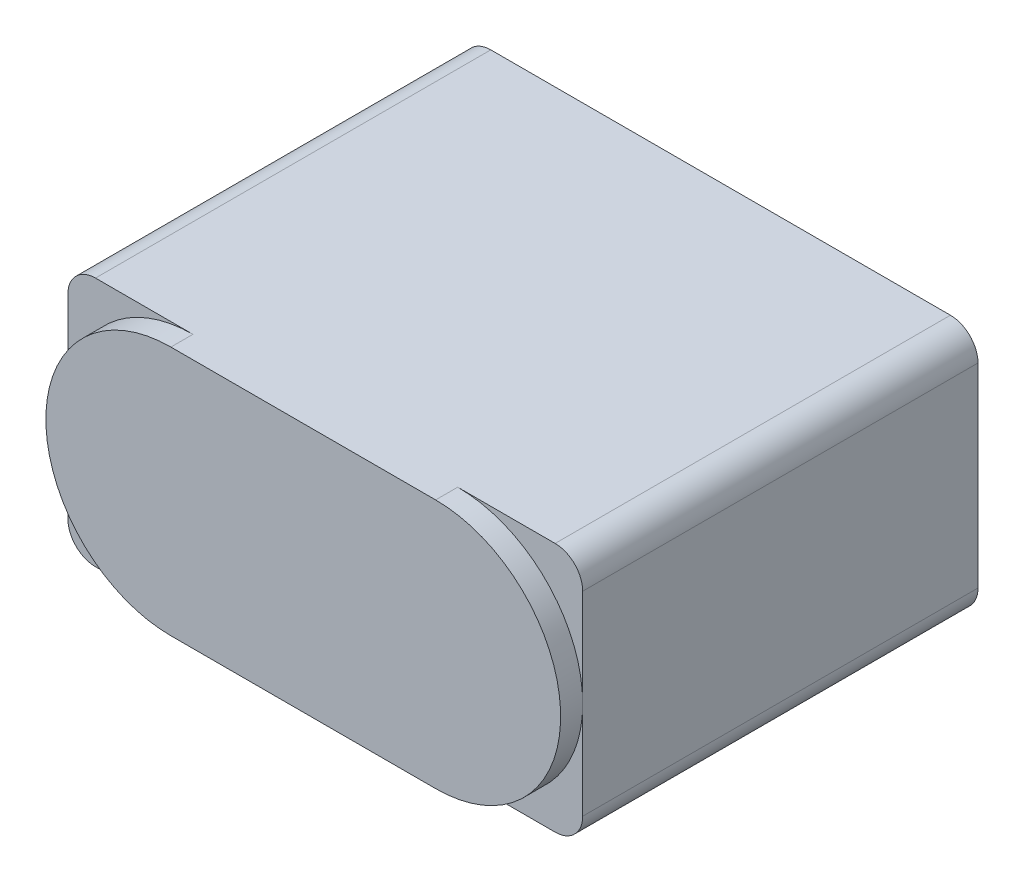
ISO-10303-21;
HEADER;
FILE_DESCRIPTION(('STEP AP214'),'2;1');
FILE_NAME('part.step','',(''),(''),'','','');
FILE_SCHEMA(('AUTOMOTIVE_DESIGN { 1 0 10303 214 1 1 1 1 }'));
ENDSEC;
DATA;
#1=APPLICATION_CONTEXT('core data for automotive mechanical design processes');
#2=APPLICATION_PROTOCOL_DEFINITION('international standard','automotive_design',2000,#1);
#3=PRODUCT_CONTEXT('',#1,'mechanical');
#4=PRODUCT('Part','Part','',(#3));
#5=PRODUCT_RELATED_PRODUCT_CATEGORY('part','',(#4));
#6=PRODUCT_DEFINITION_FORMATION('','',#4);
#7=PRODUCT_DEFINITION_CONTEXT('part definition',#1,'design');
#8=PRODUCT_DEFINITION('design','',#6,#7);
#9=PRODUCT_DEFINITION_SHAPE('','',#8);
#10=(LENGTH_UNIT() NAMED_UNIT(*) SI_UNIT(.MILLI.,.METRE.));
#11=(NAMED_UNIT(*) PLANE_ANGLE_UNIT() SI_UNIT($,.RADIAN.));
#12=(NAMED_UNIT(*) SI_UNIT($,.STERADIAN.) SOLID_ANGLE_UNIT());
#13=UNCERTAINTY_MEASURE_WITH_UNIT(LENGTH_MEASURE(1.E-05),#10,'distance_accuracy_value','');
#14=(GEOMETRIC_REPRESENTATION_CONTEXT(3) GLOBAL_UNCERTAINTY_ASSIGNED_CONTEXT((#13)) GLOBAL_UNIT_ASSIGNED_CONTEXT((#10,
#11,#12)) REPRESENTATION_CONTEXT('',''));
#15=CARTESIAN_POINT('',(0.,0.,0.));
#16=DIRECTION('',(0.,0.,1.));
#17=DIRECTION('',(1.,0.,0.));
#18=AXIS2_PLACEMENT_3D('',#15,#16,#17);
#19=CARTESIAN_POINT('',(0.,1.50000000000001,22.7));
#20=DIRECTION('',(1.,0.,0.));
#21=DIRECTION('',(0.,0.,-1.));
#22=AXIS2_PLACEMENT_3D('',#19,#20,#21);
#23=PLANE('',#22);
#24=DIRECTION('',(0.,-1.,0.));
#25=VECTOR('',#24,1.);
#26=CARTESIAN_POINT('',(0.,0.,21.5));
#27=LINE('',#26,#25);
#28=CARTESIAN_POINT('',(0.,6.8,21.5));
#29=VERTEX_POINT('',#28);
#30=CARTESIAN_POINT('',(0.,1.5,21.5));
#31=VERTEX_POINT('',#30);
#32=EDGE_CURVE('E224',#29,#31,#27,.T.);
#33=ORIENTED_EDGE('',*,*,#32,.F.);
#34=DIRECTION('',(0.,-1.,0.));
#35=VECTOR('',#34,1.);
#36=CARTESIAN_POINT('',(0.,0.,21.5));
#37=LINE('',#36,#35);
#38=CARTESIAN_POINT('',(0.,12.1,21.5));
#39=VERTEX_POINT('',#38);
#40=EDGE_CURVE('E256',#39,#29,#37,.T.);
#41=ORIENTED_EDGE('',*,*,#40,.F.);
#42=DIRECTION('',(0.,0.,-1.));
#43=VECTOR('',#42,1.);
#44=CARTESIAN_POINT('',(0.,12.1,22.7));
#45=LINE('',#44,#43);
#46=CARTESIAN_POINT('',(0.,12.1,0.));
#47=VERTEX_POINT('',#46);
#48=EDGE_CURVE('E310',#39,#47,#45,.T.);
#49=ORIENTED_EDGE('',*,*,#48,.T.);
#50=DIRECTION('',(0.,-1.,0.));
#51=VECTOR('',#50,1.);
#52=CARTESIAN_POINT('',(0.,1.50000000000001,0.));
#53=LINE('',#52,#51);
#54=CARTESIAN_POINT('',(0.,1.5,0.));
#55=VERTEX_POINT('',#54);
#56=EDGE_CURVE('E297',#47,#55,#53,.T.);
#57=ORIENTED_EDGE('',*,*,#56,.T.);
#58=DIRECTION('',(0.,0.,-1.));
#59=VECTOR('',#58,1.);
#60=CARTESIAN_POINT('',(0.,1.5,22.7));
#61=LINE('',#60,#59);
#62=EDGE_CURVE('E308',#31,#55,#61,.T.);
#63=ORIENTED_EDGE('',*,*,#62,.F.);
#64=EDGE_LOOP('',(#33,#41,#49,#57,#63));
#65=FACE_BOUND('',#64,.T.);
#66=ADVANCED_FACE('F62',(#65),#23,.F.);
#67=CARTESIAN_POINT('',(26.5,1.5,22.7));
#68=DIRECTION('',(0.,0.,1.));
#69=DIRECTION('',(1.,0.,0.));
#70=AXIS2_PLACEMENT_3D('',#67,#68,#69);
#71=PLANE('',#70);
#72=CARTESIAN_POINT('',(6.8,6.8,22.7));
#73=DIRECTION('',(0.,0.,1.));
#74=DIRECTION('',(1.,0.,0.));
#75=AXIS2_PLACEMENT_3D('',#72,#73,#74);
#76=CIRCLE('',#75,6.8);
#77=CARTESIAN_POINT('',(6.8,13.6,22.7));
#78=VERTEX_POINT('',#77);
#79=CARTESIAN_POINT('',(6.8,0.,22.7));
#80=VERTEX_POINT('',#79);
#81=EDGE_CURVE('E252',#78,#80,#76,.T.);
#82=ORIENTED_EDGE('',*,*,#81,.T.);
#83=DIRECTION('',(1.,0.,0.));
#84=VECTOR('',#83,1.);
#85=CARTESIAN_POINT('',(1.50000000000001,0.,22.7));
#86=LINE('',#85,#84);
#87=CARTESIAN_POINT('',(21.2,0.,22.7));
#88=VERTEX_POINT('',#87);
#89=EDGE_CURVE('E278',#80,#88,#86,.T.);
#90=ORIENTED_EDGE('',*,*,#89,.T.);
#91=CARTESIAN_POINT('',(21.2,6.8,22.7));
#92=DIRECTION('',(0.,0.,1.));
#93=DIRECTION('',(1.,0.,0.));
#94=AXIS2_PLACEMENT_3D('',#91,#92,#93);
#95=CIRCLE('',#94,6.8);
#96=CARTESIAN_POINT('',(21.2,13.6,22.7));
#97=VERTEX_POINT('',#96);
#98=EDGE_CURVE('E235',#88,#97,#95,.T.);
#99=ORIENTED_EDGE('',*,*,#98,.T.);
#100=DIRECTION('',(-1.,0.,0.));
#101=VECTOR('',#100,1.);
#102=CARTESIAN_POINT('',(1.50000000000001,13.6,22.7));
#103=LINE('',#102,#101);
#104=EDGE_CURVE('E275',#97,#78,#103,.T.);
#105=ORIENTED_EDGE('',*,*,#104,.T.);
#106=EDGE_LOOP('',(#82,#90,#99,#105));
#107=FACE_BOUND('',#106,.T.);
#108=ADVANCED_FACE('F371',(#107),#71,.T.);
#109=CARTESIAN_POINT('',(26.5,1.5,22.7));
#110=DIRECTION('',(0.,0.,-1.));
#111=DIRECTION('',(-1.,0.,0.));
#112=AXIS2_PLACEMENT_3D('',#109,#110,#111);
#113=CYLINDRICAL_SURFACE('',#112,1.5);
#114=CARTESIAN_POINT('',(26.5,1.5,21.5));
#115=DIRECTION('',(0.,0.,1.));
#116=DIRECTION('',(1.,0.,0.));
#117=AXIS2_PLACEMENT_3D('',#114,#115,#116);
#118=CIRCLE('',#117,1.5);
#119=CARTESIAN_POINT('',(26.5,0.,21.5));
#120=VERTEX_POINT('',#119);
#121=CARTESIAN_POINT('',(28.,1.50000000000001,21.5));
#122=VERTEX_POINT('',#121);
#123=EDGE_CURVE('E242',#120,#122,#118,.T.);
#124=ORIENTED_EDGE('',*,*,#123,.F.);
#125=DIRECTION('',(0.,0.,-1.));
#126=VECTOR('',#125,1.);
#127=CARTESIAN_POINT('',(26.5,0.,22.7));
#128=LINE('',#127,#126);
#129=CARTESIAN_POINT('',(26.5,0.,0.));
#130=VERTEX_POINT('',#129);
#131=EDGE_CURVE('E282',#120,#130,#128,.T.);
#132=ORIENTED_EDGE('',*,*,#131,.T.);
#133=CARTESIAN_POINT('',(26.5,1.5,0.));
#134=DIRECTION('',(0.,0.,1.));
#135=DIRECTION('',(1.,0.,0.));
#136=AXIS2_PLACEMENT_3D('',#133,#134,#135);
#137=CIRCLE('',#136,1.5);
#138=CARTESIAN_POINT('',(28.,1.50000000000001,0.));
#139=VERTEX_POINT('',#138);
#140=EDGE_CURVE('E263',#130,#139,#137,.T.);
#141=ORIENTED_EDGE('',*,*,#140,.T.);
#142=DIRECTION('',(0.,0.,-1.));
#143=VECTOR('',#142,1.);
#144=CARTESIAN_POINT('',(28.,1.50000000000001,22.7));
#145=LINE('',#144,#143);
#146=EDGE_CURVE('E12',#122,#139,#145,.T.);
#147=ORIENTED_EDGE('',*,*,#146,.F.);
#148=EDGE_LOOP('',(#124,#132,#141,#147));
#149=FACE_BOUND('',#148,.T.);
#150=ADVANCED_FACE('F64',(#149),#113,.T.);
#151=CARTESIAN_POINT('',(28.,1.50000000000001,22.7));
#152=DIRECTION('',(-1.,0.,0.));
#153=DIRECTION('',(0.,0.,1.));
#154=AXIS2_PLACEMENT_3D('',#151,#152,#153);
#155=PLANE('',#154);
#156=DIRECTION('',(0.,1.,0.));
#157=VECTOR('',#156,1.);
#158=CARTESIAN_POINT('',(28.,0.,21.5));
#159=LINE('',#158,#157);
#160=CARTESIAN_POINT('',(28.,6.8,21.5));
#161=VERTEX_POINT('',#160);
#162=EDGE_CURVE('E244',#122,#161,#159,.T.);
#163=ORIENTED_EDGE('',*,*,#162,.F.);
#164=ORIENTED_EDGE('',*,*,#146,.T.);
#165=DIRECTION('',(0.,1.,0.));
#166=VECTOR('',#165,1.);
#167=CARTESIAN_POINT('',(28.,1.50000000000001,0.));
#168=LINE('',#167,#166);
#169=CARTESIAN_POINT('',(28.,12.1,0.));
#170=VERTEX_POINT('',#169);
#171=EDGE_CURVE('E285',#139,#170,#168,.T.);
#172=ORIENTED_EDGE('',*,*,#171,.T.);
#173=DIRECTION('',(0.,0.,-1.));
#174=VECTOR('',#173,1.);
#175=CARTESIAN_POINT('',(28.,12.1,22.7));
#176=LINE('',#175,#174);
#177=CARTESIAN_POINT('',(28.,12.1,21.5));
#178=VERTEX_POINT('',#177);
#179=EDGE_CURVE('E70',#178,#170,#176,.T.);
#180=ORIENTED_EDGE('',*,*,#179,.F.);
#181=DIRECTION('',(0.,1.,0.));
#182=VECTOR('',#181,1.);
#183=CARTESIAN_POINT('',(28.,0.,21.5));
#184=LINE('',#183,#182);
#185=EDGE_CURVE('E266',#161,#178,#184,.T.);
#186=ORIENTED_EDGE('',*,*,#185,.F.);
#187=EDGE_LOOP('',(#163,#164,#172,#180,#186));
#188=FACE_BOUND('',#187,.T.);
#189=ADVANCED_FACE('F326',(#188),#155,.F.);
#190=CARTESIAN_POINT('',(1.5,1.5,22.7));
#191=DIRECTION('',(0.,0.,-1.));
#192=DIRECTION('',(-1.,0.,0.));
#193=AXIS2_PLACEMENT_3D('',#190,#191,#192);
#194=CYLINDRICAL_SURFACE('',#193,1.5);
#195=CARTESIAN_POINT('',(1.5,1.5,21.5));
#196=DIRECTION('',(0.,0.,1.));
#197=DIRECTION('',(1.,0.,0.));
#198=AXIS2_PLACEMENT_3D('',#195,#196,#197);
#199=CIRCLE('',#198,1.5);
#200=CARTESIAN_POINT('',(1.50000000000001,0.,21.5));
#201=VERTEX_POINT('',#200);
#202=EDGE_CURVE('E227',#31,#201,#199,.T.);
#203=ORIENTED_EDGE('',*,*,#202,.F.);
#204=ORIENTED_EDGE('',*,*,#62,.T.);
#205=CARTESIAN_POINT('',(1.5,1.5,0.));
#206=DIRECTION('',(0.,0.,1.));
#207=DIRECTION('',(-1.,0.,0.));
#208=AXIS2_PLACEMENT_3D('',#205,#206,#207);
#209=CIRCLE('',#208,1.5);
#210=CARTESIAN_POINT('',(1.50000000000001,0.,0.));
#211=VERTEX_POINT('',#210);
#212=EDGE_CURVE('E300',#55,#211,#209,.T.);
#213=ORIENTED_EDGE('',*,*,#212,.T.);
#214=DIRECTION('',(0.,0.,-1.));
#215=VECTOR('',#214,1.);
#216=CARTESIAN_POINT('',(1.50000000000001,0.,22.7));
#217=LINE('',#216,#215);
#218=EDGE_CURVE('E306',#201,#211,#217,.T.);
#219=ORIENTED_EDGE('',*,*,#218,.F.);
#220=EDGE_LOOP('',(#203,#204,#213,#219));
#221=FACE_BOUND('',#220,.T.);
#222=ADVANCED_FACE('F357',(#221),#194,.T.);
#223=CARTESIAN_POINT('',(1.50000000000001,0.,22.7));
#224=DIRECTION('',(0.,1.,0.));
#225=DIRECTION('',(0.,0.,1.));
#226=AXIS2_PLACEMENT_3D('',#223,#224,#225);
#227=PLANE('',#226);
#228=CARTESIAN_POINT('',(24.8,0.,11.6));
#229=DIRECTION('',(0.,-1.,0.));
#230=DIRECTION('',(0.,0.,-1.));
#231=AXIS2_PLACEMENT_3D('',#228,#229,#230);
#232=CIRCLE('',#231,0.750000000000002);
#233=CARTESIAN_POINT('',(24.8,0.,10.85));
#234=VERTEX_POINT('',#233);
#235=EDGE_CURVE('E670',#234,#234,#232,.T.);
#236=ORIENTED_EDGE('',*,*,#235,.F.);
#237=EDGE_LOOP('',(#236));
#238=FACE_BOUND('',#237,.T.);
#239=CARTESIAN_POINT('',(3.2,0.,11.6));
#240=DIRECTION('',(0.,-1.,0.));
#241=DIRECTION('',(0.,0.,1.));
#242=AXIS2_PLACEMENT_3D('',#239,#240,#241);
#243=CIRCLE('',#242,0.75);
#244=CARTESIAN_POINT('',(3.2,0.,12.35));
#245=VERTEX_POINT('',#244);
#246=EDGE_CURVE('E673',#245,#245,#243,.T.);
#247=ORIENTED_EDGE('',*,*,#246,.F.);
#248=EDGE_LOOP('',(#247));
#249=FACE_BOUND('',#248,.T.);
#250=DIRECTION('',(0.,0.,1.));
#251=VECTOR('',#250,1.);
#252=CARTESIAN_POINT('',(6.8,0.,21.5));
#253=LINE('',#252,#251);
#254=CARTESIAN_POINT('',(6.8,0.,21.5));
#255=VERTEX_POINT('',#254);
#256=EDGE_CURVE('E232',#255,#80,#253,.T.);
#257=ORIENTED_EDGE('',*,*,#256,.F.);
#258=DIRECTION('',(1.,0.,0.));
#259=VECTOR('',#258,1.);
#260=CARTESIAN_POINT('',(0.,0.,21.5));
#261=LINE('',#260,#259);
#262=EDGE_CURVE('E229',#201,#255,#261,.T.);
#263=ORIENTED_EDGE('',*,*,#262,.F.);
#264=ORIENTED_EDGE('',*,*,#218,.T.);
#265=DIRECTION('',(1.,0.,0.));
#266=VECTOR('',#265,1.);
#267=CARTESIAN_POINT('',(1.50000000000001,0.,0.));
#268=LINE('',#267,#266);
#269=EDGE_CURVE('E279',#211,#130,#268,.T.);
#270=ORIENTED_EDGE('',*,*,#269,.T.);
#271=ORIENTED_EDGE('',*,*,#131,.F.);
#272=DIRECTION('',(1.,0.,0.));
#273=VECTOR('',#272,1.);
#274=CARTESIAN_POINT('',(0.,0.,21.5));
#275=LINE('',#274,#273);
#276=CARTESIAN_POINT('',(21.2,0.,21.5));
#277=VERTEX_POINT('',#276);
#278=EDGE_CURVE('E239',#277,#120,#275,.T.);
#279=ORIENTED_EDGE('',*,*,#278,.F.);
#280=DIRECTION('',(0.,0.,1.));
#281=VECTOR('',#280,1.);
#282=CARTESIAN_POINT('',(21.2,0.,21.5));
#283=LINE('',#282,#281);
#284=EDGE_CURVE('E225',#277,#88,#283,.T.);
#285=ORIENTED_EDGE('',*,*,#284,.T.);
#286=ORIENTED_EDGE('',*,*,#89,.F.);
#287=EDGE_LOOP('',(#257,#263,#264,#270,#271,#279,#285,#286));
#288=FACE_BOUND('',#287,.T.);
#289=ADVANCED_FACE('F351',(#238,#249,#288),#227,.F.);
#290=CARTESIAN_POINT('',(26.5,12.1,22.7));
#291=DIRECTION('',(0.,0.,-1.));
#292=DIRECTION('',(-1.,0.,0.));
#293=AXIS2_PLACEMENT_3D('',#290,#291,#292);
#294=CYLINDRICAL_SURFACE('',#293,1.5);
#295=CARTESIAN_POINT('',(26.5,12.1,21.5));
#296=DIRECTION('',(0.,0.,1.));
#297=DIRECTION('',(1.,0.,0.));
#298=AXIS2_PLACEMENT_3D('',#295,#296,#297);
#299=CIRCLE('',#298,1.5);
#300=CARTESIAN_POINT('',(26.5,13.6,21.5));
#301=VERTEX_POINT('',#300);
#302=EDGE_CURVE('E268',#178,#301,#299,.T.);
#303=ORIENTED_EDGE('',*,*,#302,.F.);
#304=ORIENTED_EDGE('',*,*,#179,.T.);
#305=CARTESIAN_POINT('',(26.5,12.1,0.));
#306=DIRECTION('',(0.,0.,1.));
#307=DIRECTION('',(-1.,0.,0.));
#308=AXIS2_PLACEMENT_3D('',#305,#306,#307);
#309=CIRCLE('',#308,1.5);
#310=CARTESIAN_POINT('',(26.5,13.6,0.));
#311=VERTEX_POINT('',#310);
#312=EDGE_CURVE('E288',#170,#311,#309,.T.);
#313=ORIENTED_EDGE('',*,*,#312,.T.);
#314=DIRECTION('',(0.,0.,-1.));
#315=VECTOR('',#314,1.);
#316=CARTESIAN_POINT('',(26.5,13.6,22.7));
#317=LINE('',#316,#315);
#318=EDGE_CURVE('E314',#301,#311,#317,.T.);
#319=ORIENTED_EDGE('',*,*,#318,.F.);
#320=EDGE_LOOP('',(#303,#304,#313,#319));
#321=FACE_BOUND('',#320,.T.);
#322=ADVANCED_FACE('F318',(#321),#294,.T.);
#323=CARTESIAN_POINT('',(1.50000000000001,13.6,22.7));
#324=DIRECTION('',(0.,-1.,0.));
#325=DIRECTION('',(0.,0.,-1.));
#326=AXIS2_PLACEMENT_3D('',#323,#324,#325);
#327=PLANE('',#326);
#328=DIRECTION('',(-1.,0.,0.));
#329=VECTOR('',#328,1.);
#330=CARTESIAN_POINT('',(0.,13.6,21.5));
#331=LINE('',#330,#329);
#332=CARTESIAN_POINT('',(6.8,13.6,21.5));
#333=VERTEX_POINT('',#332);
#334=CARTESIAN_POINT('',(1.50000000000001,13.6,21.5));
#335=VERTEX_POINT('',#334);
#336=EDGE_CURVE('E251',#333,#335,#331,.T.);
#337=ORIENTED_EDGE('',*,*,#336,.F.);
#338=DIRECTION('',(0.,0.,1.));
#339=VECTOR('',#338,1.);
#340=CARTESIAN_POINT('',(6.8,13.6,21.5));
#341=LINE('',#340,#339);
#342=EDGE_CURVE('E259',#333,#78,#341,.T.);
#343=ORIENTED_EDGE('',*,*,#342,.T.);
#344=ORIENTED_EDGE('',*,*,#104,.F.);
#345=DIRECTION('',(0.,0.,1.));
#346=VECTOR('',#345,1.);
#347=CARTESIAN_POINT('',(21.2,13.6,21.5));
#348=LINE('',#347,#346);
#349=CARTESIAN_POINT('',(21.2,13.6,21.5));
#350=VERTEX_POINT('',#349);
#351=EDGE_CURVE('E85',#350,#97,#348,.T.);
#352=ORIENTED_EDGE('',*,*,#351,.F.);
#353=DIRECTION('',(-1.,0.,0.));
#354=VECTOR('',#353,1.);
#355=CARTESIAN_POINT('',(0.,13.6,21.5));
#356=LINE('',#355,#354);
#357=EDGE_CURVE('E270',#301,#350,#356,.T.);
#358=ORIENTED_EDGE('',*,*,#357,.F.);
#359=ORIENTED_EDGE('',*,*,#318,.T.);
#360=DIRECTION('',(-1.,0.,0.));
#361=VECTOR('',#360,1.);
#362=CARTESIAN_POINT('',(1.50000000000001,13.6,0.));
#363=LINE('',#362,#361);
#364=CARTESIAN_POINT('',(1.50000000000001,13.6,0.));
#365=VERTEX_POINT('',#364);
#366=EDGE_CURVE('E291',#311,#365,#363,.T.);
#367=ORIENTED_EDGE('',*,*,#366,.T.);
#368=DIRECTION('',(0.,0.,-1.));
#369=VECTOR('',#368,1.);
#370=CARTESIAN_POINT('',(1.50000000000001,13.6,22.7));
#371=LINE('',#370,#369);
#372=EDGE_CURVE('E312',#335,#365,#371,.T.);
#373=ORIENTED_EDGE('',*,*,#372,.F.);
#374=EDGE_LOOP('',(#337,#343,#344,#352,#358,#359,#367,#373));
#375=FACE_BOUND('',#374,.T.);
#376=ADVANCED_FACE('F336',(#375),#327,.F.);
#377=CARTESIAN_POINT('',(1.5,12.1,22.7));
#378=DIRECTION('',(0.,0.,-1.));
#379=DIRECTION('',(-1.,0.,0.));
#380=AXIS2_PLACEMENT_3D('',#377,#378,#379);
#381=CYLINDRICAL_SURFACE('',#380,1.5);
#382=CARTESIAN_POINT('',(1.5,12.1,21.5));
#383=DIRECTION('',(0.,0.,1.));
#384=DIRECTION('',(1.,0.,0.));
#385=AXIS2_PLACEMENT_3D('',#382,#383,#384);
#386=CIRCLE('',#385,1.5);
#387=EDGE_CURVE('E254',#335,#39,#386,.T.);
#388=ORIENTED_EDGE('',*,*,#387,.F.);
#389=ORIENTED_EDGE('',*,*,#372,.T.);
#390=CARTESIAN_POINT('',(1.5,12.1,0.));
#391=DIRECTION('',(0.,0.,1.));
#392=DIRECTION('',(-1.,0.,0.));
#393=AXIS2_PLACEMENT_3D('',#390,#391,#392);
#394=CIRCLE('',#393,1.5);
#395=EDGE_CURVE('E294',#365,#47,#394,.T.);
#396=ORIENTED_EDGE('',*,*,#395,.T.);
#397=ORIENTED_EDGE('',*,*,#48,.F.);
#398=EDGE_LOOP('',(#388,#389,#396,#397));
#399=FACE_BOUND('',#398,.T.);
#400=ADVANCED_FACE('F365',(#399),#381,.T.);
#401=CARTESIAN_POINT('',(26.5,1.5,0.));
#402=DIRECTION('',(0.,0.,1.));
#403=DIRECTION('',(1.,0.,0.));
#404=AXIS2_PLACEMENT_3D('',#401,#402,#403);
#405=PLANE('',#404);
#406=CARTESIAN_POINT('',(24.8,6.8,0.));
#407=DIRECTION('',(0.,0.,-1.));
#408=DIRECTION('',(-1.,0.,0.));
#409=AXIS2_PLACEMENT_3D('',#406,#407,#408);
#410=CIRCLE('',#409,1.25);
#411=CARTESIAN_POINT('',(23.55,6.8,0.));
#412=VERTEX_POINT('',#411);
#413=EDGE_CURVE('E683',#412,#412,#410,.T.);
#414=ORIENTED_EDGE('',*,*,#413,.F.);
#415=EDGE_LOOP('',(#414));
#416=FACE_BOUND('',#415,.T.);
#417=CARTESIAN_POINT('',(3.2,6.8,0.));
#418=DIRECTION('',(0.,0.,-1.));
#419=DIRECTION('',(1.,0.,0.));
#420=AXIS2_PLACEMENT_3D('',#417,#418,#419);
#421=CIRCLE('',#420,1.25);
#422=CARTESIAN_POINT('',(4.45,6.8,0.));
#423=VERTEX_POINT('',#422);
#424=EDGE_CURVE('E206',#423,#423,#421,.T.);
#425=ORIENTED_EDGE('',*,*,#424,.F.);
#426=EDGE_LOOP('',(#425));
#427=FACE_BOUND('',#426,.T.);
#428=DIRECTION('',(-1.,0.,0.));
#429=VECTOR('',#428,1.);
#430=CARTESIAN_POINT('',(18.,3.8,0.));
#431=LINE('',#430,#429);
#432=CARTESIAN_POINT('',(18.,3.8,0.));
#433=VERTEX_POINT('',#432);
#434=CARTESIAN_POINT('',(10.,3.8,0.));
#435=VERTEX_POINT('',#434);
#436=EDGE_CURVE('E212',#433,#435,#431,.T.);
#437=ORIENTED_EDGE('',*,*,#436,.F.);
#438=DIRECTION('',(0.,-1.,0.));
#439=VECTOR('',#438,1.);
#440=CARTESIAN_POINT('',(18.,9.8,0.));
#441=LINE('',#440,#439);
#442=CARTESIAN_POINT('',(18.,9.8,0.));
#443=VERTEX_POINT('',#442);
#444=EDGE_CURVE('E77',#443,#433,#441,.T.);
#445=ORIENTED_EDGE('',*,*,#444,.F.);
#446=DIRECTION('',(1.,0.,0.));
#447=VECTOR('',#446,1.);
#448=CARTESIAN_POINT('',(18.,9.8,0.));
#449=LINE('',#448,#447);
#450=CARTESIAN_POINT('',(10.,9.8,0.));
#451=VERTEX_POINT('',#450);
#452=EDGE_CURVE('E200',#451,#443,#449,.T.);
#453=ORIENTED_EDGE('',*,*,#452,.F.);
#454=DIRECTION('',(0.,1.,0.));
#455=VECTOR('',#454,1.);
#456=CARTESIAN_POINT('',(10.,9.8,0.));
#457=LINE('',#456,#455);
#458=EDGE_CURVE('E203',#435,#451,#457,.T.);
#459=ORIENTED_EDGE('',*,*,#458,.F.);
#460=EDGE_LOOP('',(#437,#445,#453,#459));
#461=FACE_BOUND('',#460,.T.);
#462=ORIENTED_EDGE('',*,*,#140,.F.);
#463=ORIENTED_EDGE('',*,*,#269,.F.);
#464=ORIENTED_EDGE('',*,*,#212,.F.);
#465=ORIENTED_EDGE('',*,*,#56,.F.);
#466=ORIENTED_EDGE('',*,*,#395,.F.);
#467=ORIENTED_EDGE('',*,*,#366,.F.);
#468=ORIENTED_EDGE('',*,*,#312,.F.);
#469=ORIENTED_EDGE('',*,*,#171,.F.);
#470=EDGE_LOOP('',(#462,#463,#464,#465,#466,#467,#468,#469));
#471=FACE_BOUND('',#470,.T.);
#472=ADVANCED_FACE('F330',(#416,#427,#461,#471),#405,.F.);
#473=CARTESIAN_POINT('',(21.2,6.8,21.5));
#474=DIRECTION('',(0.,0.,1.));
#475=DIRECTION('',(1.,0.,0.));
#476=AXIS2_PLACEMENT_3D('',#473,#474,#475);
#477=CYLINDRICAL_SURFACE('',#476,6.8);
#478=ORIENTED_EDGE('',*,*,#98,.F.);
#479=ORIENTED_EDGE('',*,*,#284,.F.);
#480=CARTESIAN_POINT('',(21.2,6.8,21.5));
#481=DIRECTION('',(0.,0.,1.));
#482=DIRECTION('',(1.,0.,0.));
#483=AXIS2_PLACEMENT_3D('',#480,#481,#482);
#484=CIRCLE('',#483,6.8);
#485=EDGE_CURVE('E236',#277,#161,#484,.T.);
#486=ORIENTED_EDGE('',*,*,#485,.T.);
#487=CARTESIAN_POINT('',(21.2,6.8,21.5));
#488=DIRECTION('',(0.,0.,1.));
#489=DIRECTION('',(1.,0.,0.));
#490=AXIS2_PLACEMENT_3D('',#487,#488,#489);
#491=CIRCLE('',#490,6.8);
#492=EDGE_CURVE('E264',#161,#350,#491,.T.);
#493=ORIENTED_EDGE('',*,*,#492,.T.);
#494=ORIENTED_EDGE('',*,*,#351,.T.);
#495=EDGE_LOOP('',(#478,#479,#486,#493,#494));
#496=FACE_BOUND('',#495,.T.);
#497=ADVANCED_FACE('F373',(#496),#477,.T.);
#498=CARTESIAN_POINT('',(0.,0.,21.5));
#499=DIRECTION('',(0.,0.,1.));
#500=DIRECTION('',(1.,0.,0.));
#501=AXIS2_PLACEMENT_3D('',#498,#499,#500);
#502=PLANE('',#501);
#503=ORIENTED_EDGE('',*,*,#492,.F.);
#504=ORIENTED_EDGE('',*,*,#185,.T.);
#505=ORIENTED_EDGE('',*,*,#302,.T.);
#506=ORIENTED_EDGE('',*,*,#357,.T.);
#507=EDGE_LOOP('',(#503,#504,#505,#506));
#508=FACE_BOUND('',#507,.T.);
#509=ADVANCED_FACE('F341',(#508),#502,.T.);
#510=CARTESIAN_POINT('',(6.8,6.8,21.5));
#511=DIRECTION('',(0.,0.,1.));
#512=DIRECTION('',(1.,0.,0.));
#513=AXIS2_PLACEMENT_3D('',#510,#511,#512);
#514=CYLINDRICAL_SURFACE('',#513,6.8);
#515=ORIENTED_EDGE('',*,*,#81,.F.);
#516=ORIENTED_EDGE('',*,*,#342,.F.);
#517=CARTESIAN_POINT('',(6.8,6.8,21.5));
#518=DIRECTION('',(0.,0.,1.));
#519=DIRECTION('',(1.,0.,0.));
#520=AXIS2_PLACEMENT_3D('',#517,#518,#519);
#521=CIRCLE('',#520,6.8);
#522=EDGE_CURVE('E248',#333,#29,#521,.T.);
#523=ORIENTED_EDGE('',*,*,#522,.T.);
#524=CARTESIAN_POINT('',(6.8,6.8,21.5));
#525=DIRECTION('',(0.,0.,1.));
#526=DIRECTION('',(1.,0.,0.));
#527=AXIS2_PLACEMENT_3D('',#524,#525,#526);
#528=CIRCLE('',#527,6.8);
#529=EDGE_CURVE('E222',#29,#255,#528,.T.);
#530=ORIENTED_EDGE('',*,*,#529,.T.);
#531=ORIENTED_EDGE('',*,*,#256,.T.);
#532=EDGE_LOOP('',(#515,#516,#523,#530,#531));
#533=FACE_BOUND('',#532,.T.);
#534=ADVANCED_FACE('F437',(#533),#514,.T.);
#535=CARTESIAN_POINT('',(0.,0.,21.5));
#536=DIRECTION('',(0.,0.,1.));
#537=DIRECTION('',(1.,0.,0.));
#538=AXIS2_PLACEMENT_3D('',#535,#536,#537);
#539=PLANE('',#538);
#540=ORIENTED_EDGE('',*,*,#522,.F.);
#541=ORIENTED_EDGE('',*,*,#336,.T.);
#542=ORIENTED_EDGE('',*,*,#387,.T.);
#543=ORIENTED_EDGE('',*,*,#40,.T.);
#544=EDGE_LOOP('',(#540,#541,#542,#543));
#545=FACE_BOUND('',#544,.T.);
#546=ADVANCED_FACE('F368',(#545),#539,.T.);
#547=CARTESIAN_POINT('',(0.,0.,21.5));
#548=DIRECTION('',(0.,0.,1.));
#549=DIRECTION('',(1.,0.,0.));
#550=AXIS2_PLACEMENT_3D('',#547,#548,#549);
#551=PLANE('',#550);
#552=ORIENTED_EDGE('',*,*,#529,.F.);
#553=ORIENTED_EDGE('',*,*,#32,.T.);
#554=ORIENTED_EDGE('',*,*,#202,.T.);
#555=ORIENTED_EDGE('',*,*,#262,.T.);
#556=EDGE_LOOP('',(#552,#553,#554,#555));
#557=FACE_BOUND('',#556,.T.);
#558=ADVANCED_FACE('F376',(#557),#551,.T.);
#559=CARTESIAN_POINT('',(0.,0.,21.5));
#560=DIRECTION('',(0.,0.,1.));
#561=DIRECTION('',(1.,0.,0.));
#562=AXIS2_PLACEMENT_3D('',#559,#560,#561);
#563=PLANE('',#562);
#564=ORIENTED_EDGE('',*,*,#485,.F.);
#565=ORIENTED_EDGE('',*,*,#278,.T.);
#566=ORIENTED_EDGE('',*,*,#123,.T.);
#567=ORIENTED_EDGE('',*,*,#162,.T.);
#568=EDGE_LOOP('',(#564,#565,#566,#567));
#569=FACE_BOUND('',#568,.T.);
#570=ADVANCED_FACE('F374',(#569),#563,.T.);
#571=CARTESIAN_POINT('',(18.,9.8,5.));
#572=DIRECTION('',(1.,0.,0.));
#573=DIRECTION('',(0.,0.,-1.));
#574=AXIS2_PLACEMENT_3D('',#571,#572,#573);
#575=PLANE('',#574);
#576=ORIENTED_EDGE('',*,*,#444,.T.);
#577=DIRECTION('',(0.,0.,-1.));
#578=VECTOR('',#577,1.);
#579=CARTESIAN_POINT('',(18.,3.8,5.));
#580=LINE('',#579,#578);
#581=CARTESIAN_POINT('',(18.,3.8,5.));
#582=VERTEX_POINT('',#581);
#583=EDGE_CURVE('E178',#582,#433,#580,.T.);
#584=ORIENTED_EDGE('',*,*,#583,.F.);
#585=DIRECTION('',(0.,-1.,0.));
#586=VECTOR('',#585,1.);
#587=CARTESIAN_POINT('',(18.,9.8,5.));
#588=LINE('',#587,#586);
#589=CARTESIAN_POINT('',(18.,9.8,5.));
#590=VERTEX_POINT('',#589);
#591=EDGE_CURVE('E182',#590,#582,#588,.T.);
#592=ORIENTED_EDGE('',*,*,#591,.F.);
#593=DIRECTION('',(0.,0.,-1.));
#594=VECTOR('',#593,1.);
#595=CARTESIAN_POINT('',(18.,9.8,5.));
#596=LINE('',#595,#594);
#597=EDGE_CURVE('E217',#590,#443,#596,.T.);
#598=ORIENTED_EDGE('',*,*,#597,.T.);
#599=EDGE_LOOP('',(#576,#584,#592,#598));
#600=FACE_BOUND('',#599,.T.);
#601=ADVANCED_FACE('F180',(#600),#575,.F.);
#602=CARTESIAN_POINT('',(18.,9.8,5.));
#603=DIRECTION('',(0.,1.,0.));
#604=DIRECTION('',(-1.,0.,0.));
#605=AXIS2_PLACEMENT_3D('',#602,#603,#604);
#606=PLANE('',#605);
#607=ORIENTED_EDGE('',*,*,#452,.T.);
#608=ORIENTED_EDGE('',*,*,#597,.F.);
#609=DIRECTION('',(1.,0.,0.));
#610=VECTOR('',#609,1.);
#611=CARTESIAN_POINT('',(18.,9.8,5.));
#612=LINE('',#611,#610);
#613=CARTESIAN_POINT('',(10.,9.8,5.));
#614=VERTEX_POINT('',#613);
#615=EDGE_CURVE('E188',#614,#590,#612,.T.);
#616=ORIENTED_EDGE('',*,*,#615,.F.);
#617=DIRECTION('',(0.,0.,-1.));
#618=VECTOR('',#617,1.);
#619=CARTESIAN_POINT('',(10.,9.8,5.));
#620=LINE('',#619,#618);
#621=EDGE_CURVE('E219',#614,#451,#620,.T.);
#622=ORIENTED_EDGE('',*,*,#621,.T.);
#623=EDGE_LOOP('',(#607,#608,#616,#622));
#624=FACE_BOUND('',#623,.T.);
#625=ADVANCED_FACE('F382',(#624),#606,.F.);
#626=CARTESIAN_POINT('',(10.,9.8,5.));
#627=DIRECTION('',(-1.,0.,0.));
#628=DIRECTION('',(0.,-1.,0.));
#629=AXIS2_PLACEMENT_3D('',#626,#627,#628);
#630=PLANE('',#629);
#631=ORIENTED_EDGE('',*,*,#458,.T.);
#632=ORIENTED_EDGE('',*,*,#621,.F.);
#633=DIRECTION('',(0.,1.,0.));
#634=VECTOR('',#633,1.);
#635=CARTESIAN_POINT('',(10.,9.8,5.));
#636=LINE('',#635,#634);
#637=CARTESIAN_POINT('',(10.,3.8,5.));
#638=VERTEX_POINT('',#637);
#639=EDGE_CURVE('E196',#638,#614,#636,.T.);
#640=ORIENTED_EDGE('',*,*,#639,.F.);
#641=DIRECTION('',(0.,0.,-1.));
#642=VECTOR('',#641,1.);
#643=CARTESIAN_POINT('',(10.,3.8,5.));
#644=LINE('',#643,#642);
#645=EDGE_CURVE('E187',#638,#435,#644,.T.);
#646=ORIENTED_EDGE('',*,*,#645,.T.);
#647=EDGE_LOOP('',(#631,#632,#640,#646));
#648=FACE_BOUND('',#647,.T.);
#649=ADVANCED_FACE('F476',(#648),#630,.F.);
#650=CARTESIAN_POINT('',(18.,3.8,5.));
#651=DIRECTION('',(0.,-1.,0.));
#652=DIRECTION('',(1.,0.,0.));
#653=AXIS2_PLACEMENT_3D('',#650,#651,#652);
#654=PLANE('',#653);
#655=ORIENTED_EDGE('',*,*,#436,.T.);
#656=ORIENTED_EDGE('',*,*,#645,.F.);
#657=DIRECTION('',(-1.,0.,0.));
#658=VECTOR('',#657,1.);
#659=CARTESIAN_POINT('',(18.,3.8,5.));
#660=LINE('',#659,#658);
#661=EDGE_CURVE('E191',#582,#638,#660,.T.);
#662=ORIENTED_EDGE('',*,*,#661,.F.);
#663=ORIENTED_EDGE('',*,*,#583,.T.);
#664=EDGE_LOOP('',(#655,#656,#662,#663));
#665=FACE_BOUND('',#664,.T.);
#666=ADVANCED_FACE('F192',(#665),#654,.F.);
#667=CARTESIAN_POINT('',(0.,0.,5.));
#668=DIRECTION('',(0.,0.,-1.));
#669=DIRECTION('',(-1.,0.,0.));
#670=AXIS2_PLACEMENT_3D('',#667,#668,#669);
#671=PLANE('',#670);
#672=ORIENTED_EDGE('',*,*,#591,.T.);
#673=ORIENTED_EDGE('',*,*,#661,.T.);
#674=ORIENTED_EDGE('',*,*,#639,.T.);
#675=ORIENTED_EDGE('',*,*,#615,.T.);
#676=EDGE_LOOP('',(#672,#673,#674,#675));
#677=FACE_BOUND('',#676,.T.);
#678=ADVANCED_FACE('F198',(#677),#671,.T.);
#679=CARTESIAN_POINT('',(3.2,6.8,5.));
#680=DIRECTION('',(0.,0.,-1.));
#681=DIRECTION('',(-1.,0.,0.));
#682=AXIS2_PLACEMENT_3D('',#679,#680,#681);
#683=CYLINDRICAL_SURFACE('',#682,1.25);
#684=CARTESIAN_POINT('',(3.2,6.8,5.));
#685=DIRECTION('',(0.,0.,-1.));
#686=DIRECTION('',(1.,0.,0.));
#687=AXIS2_PLACEMENT_3D('',#684,#685,#686);
#688=CIRCLE('',#687,1.25);
#689=CARTESIAN_POINT('',(4.45,6.8,5.));
#690=VERTEX_POINT('',#689);
#691=EDGE_CURVE('E685',#690,#690,#688,.T.);
#692=ORIENTED_EDGE('',*,*,#691,.F.);
#693=EDGE_LOOP('',(#692));
#694=FACE_BOUND('',#693,.T.);
#695=ORIENTED_EDGE('',*,*,#424,.T.);
#696=EDGE_LOOP('',(#695));
#697=FACE_BOUND('',#696,.T.);
#698=ADVANCED_FACE('F500',(#694,#697),#683,.F.);
#699=CARTESIAN_POINT('',(3.2,6.8,5.));
#700=DIRECTION('',(0.,0.,1.));
#701=DIRECTION('',(1.,0.,0.));
#702=AXIS2_PLACEMENT_3D('',#699,#700,#701);
#703=PLANE('',#702);
#704=ORIENTED_EDGE('',*,*,#691,.T.);
#705=EDGE_LOOP('',(#704));
#706=FACE_BOUND('',#705,.T.);
#707=ADVANCED_FACE('F508',(#706),#703,.F.);
#708=CARTESIAN_POINT('',(24.8,6.8,5.));
#709=DIRECTION('',(0.,0.,-1.));
#710=DIRECTION('',(-1.,0.,0.));
#711=AXIS2_PLACEMENT_3D('',#708,#709,#710);
#712=CYLINDRICAL_SURFACE('',#711,1.25);
#713=CARTESIAN_POINT('',(24.8,6.8,5.));
#714=DIRECTION('',(0.,0.,-1.));
#715=DIRECTION('',(-1.,0.,0.));
#716=AXIS2_PLACEMENT_3D('',#713,#714,#715);
#717=CIRCLE('',#716,1.25);
#718=CARTESIAN_POINT('',(23.55,6.8,5.));
#719=VERTEX_POINT('',#718);
#720=EDGE_CURVE('E240',#719,#719,#717,.T.);
#721=ORIENTED_EDGE('',*,*,#720,.F.);
#722=EDGE_LOOP('',(#721));
#723=FACE_BOUND('',#722,.T.);
#724=ORIENTED_EDGE('',*,*,#413,.T.);
#725=EDGE_LOOP('',(#724));
#726=FACE_BOUND('',#725,.T.);
#727=ADVANCED_FACE('F518',(#723,#726),#712,.F.);
#728=CARTESIAN_POINT('',(24.8,6.8,5.));
#729=DIRECTION('',(0.,0.,-1.));
#730=DIRECTION('',(-1.,0.,0.));
#731=AXIS2_PLACEMENT_3D('',#728,#729,#730);
#732=PLANE('',#731);
#733=ORIENTED_EDGE('',*,*,#720,.T.);
#734=EDGE_LOOP('',(#733));
#735=FACE_BOUND('',#734,.T.);
#736=ADVANCED_FACE('F527',(#735),#732,.T.);
#737=CARTESIAN_POINT('',(3.2,5.,11.6));
#738=DIRECTION('',(0.,-1.,0.));
#739=DIRECTION('',(0.,0.,-1.));
#740=AXIS2_PLACEMENT_3D('',#737,#738,#739);
#741=CYLINDRICAL_SURFACE('',#740,0.75);
#742=CARTESIAN_POINT('',(3.2,5.,11.6));
#743=DIRECTION('',(0.,-1.,0.));
#744=DIRECTION('',(0.,0.,1.));
#745=AXIS2_PLACEMENT_3D('',#742,#743,#744);
#746=CIRCLE('',#745,0.75);
#747=CARTESIAN_POINT('',(3.2,5.,12.35));
#748=VERTEX_POINT('',#747);
#749=EDGE_CURVE('E675',#748,#748,#746,.T.);
#750=ORIENTED_EDGE('',*,*,#749,.F.);
#751=EDGE_LOOP('',(#750));
#752=FACE_BOUND('',#751,.T.);
#753=ORIENTED_EDGE('',*,*,#246,.T.);
#754=EDGE_LOOP('',(#753));
#755=FACE_BOUND('',#754,.T.);
#756=ADVANCED_FACE('F537',(#752,#755),#741,.F.);
#757=CARTESIAN_POINT('',(3.2,5.,11.6));
#758=DIRECTION('',(0.,1.,0.));
#759=DIRECTION('',(0.,0.,1.));
#760=AXIS2_PLACEMENT_3D('',#757,#758,#759);
#761=PLANE('',#760);
#762=ORIENTED_EDGE('',*,*,#749,.T.);
#763=EDGE_LOOP('',(#762));
#764=FACE_BOUND('',#763,.T.);
#765=ADVANCED_FACE('F547',(#764),#761,.F.);
#766=CARTESIAN_POINT('',(24.8,5.,11.6));
#767=DIRECTION('',(0.,-1.,0.));
#768=DIRECTION('',(0.,0.,-1.));
#769=AXIS2_PLACEMENT_3D('',#766,#767,#768);
#770=CYLINDRICAL_SURFACE('',#769,0.750000000000002);
#771=CARTESIAN_POINT('',(24.8,5.,11.6));
#772=DIRECTION('',(0.,-1.,0.));
#773=DIRECTION('',(0.,0.,-1.));
#774=AXIS2_PLACEMENT_3D('',#771,#772,#773);
#775=CIRCLE('',#774,0.750000000000002);
#776=CARTESIAN_POINT('',(24.8,5.,10.85));
#777=VERTEX_POINT('',#776);
#778=EDGE_CURVE('E213',#777,#777,#775,.T.);
#779=ORIENTED_EDGE('',*,*,#778,.F.);
#780=EDGE_LOOP('',(#779));
#781=FACE_BOUND('',#780,.T.);
#782=ORIENTED_EDGE('',*,*,#235,.T.);
#783=EDGE_LOOP('',(#782));
#784=FACE_BOUND('',#783,.T.);
#785=ADVANCED_FACE('F557',(#781,#784),#770,.F.);
#786=CARTESIAN_POINT('',(24.8,5.,11.6));
#787=DIRECTION('',(0.,-1.,0.));
#788=DIRECTION('',(0.,0.,-1.));
#789=AXIS2_PLACEMENT_3D('',#786,#787,#788);
#790=PLANE('',#789);
#791=ORIENTED_EDGE('',*,*,#778,.T.);
#792=EDGE_LOOP('',(#791));
#793=FACE_BOUND('',#792,.T.);
#794=ADVANCED_FACE('F566',(#793),#790,.T.);
#795=CLOSED_SHELL('',(#66,#108,#150,#189,#222,#289,#322,#376,#400,#472,#497,#509,#534,#546,#558,
#570,#601,#625,#649,#666,#678,#698,#707,#727,#736,#756,#765,#785,#794));
#796=MANIFOLD_SOLID_BREP('B2',#795);
#797=ADVANCED_BREP_SHAPE_REPRESENTATION('',(#18,#796),#14);
#798=SHAPE_DEFINITION_REPRESENTATION(#9,#797);
ENDSEC;
END-ISO-10303-21;
